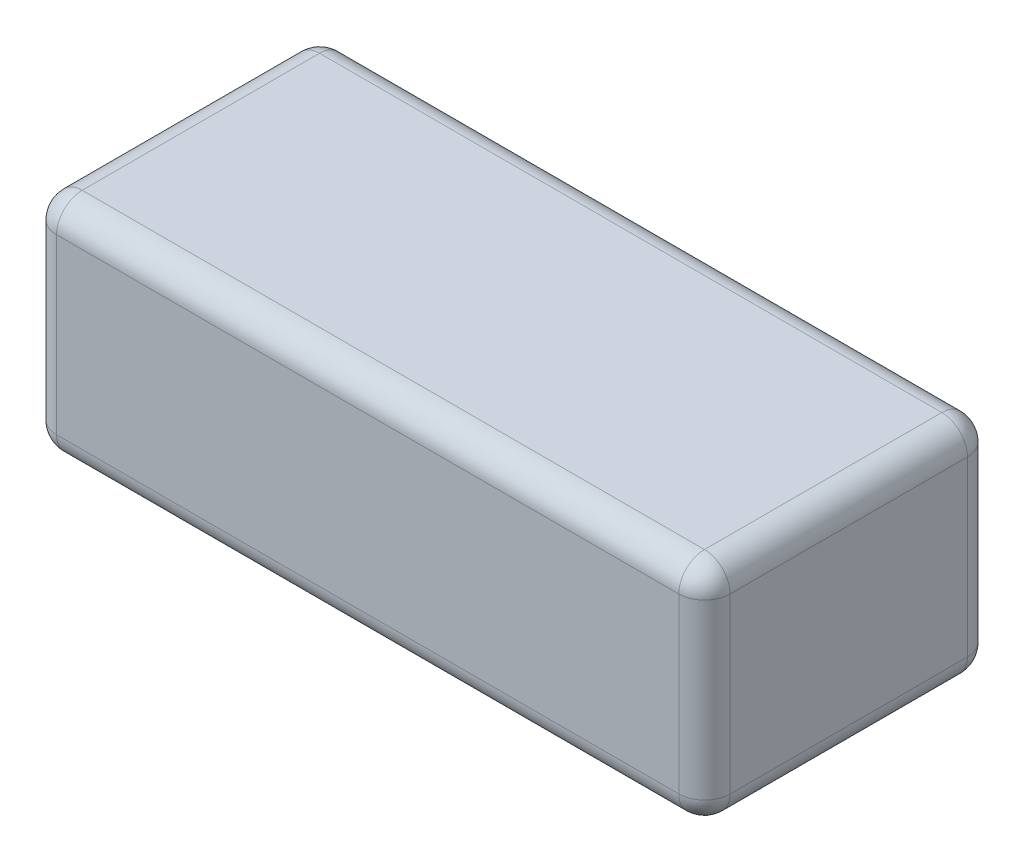
ISO-10303-21;
HEADER;
FILE_DESCRIPTION(('STEP AP214'),'2;1');
FILE_NAME('part.step','',(''),(''),'','','');
FILE_SCHEMA(('AUTOMOTIVE_DESIGN { 1 0 10303 214 1 1 1 1 }'));
ENDSEC;
DATA;
#1=APPLICATION_CONTEXT('core data for automotive mechanical design processes');
#2=APPLICATION_PROTOCOL_DEFINITION('international standard','automotive_design',2000,#1);
#3=PRODUCT_CONTEXT('',#1,'mechanical');
#4=PRODUCT('Part','Part','',(#3));
#5=PRODUCT_RELATED_PRODUCT_CATEGORY('part','',(#4));
#6=PRODUCT_DEFINITION_FORMATION('','',#4);
#7=PRODUCT_DEFINITION_CONTEXT('part definition',#1,'design');
#8=PRODUCT_DEFINITION('design','',#6,#7);
#9=PRODUCT_DEFINITION_SHAPE('','',#8);
#10=(LENGTH_UNIT() NAMED_UNIT(*) SI_UNIT(.MILLI.,.METRE.));
#11=(NAMED_UNIT(*) PLANE_ANGLE_UNIT() SI_UNIT($,.RADIAN.));
#12=(NAMED_UNIT(*) SI_UNIT($,.STERADIAN.) SOLID_ANGLE_UNIT());
#13=UNCERTAINTY_MEASURE_WITH_UNIT(LENGTH_MEASURE(1.E-05),#10,'distance_accuracy_value','');
#14=(GEOMETRIC_REPRESENTATION_CONTEXT(3) GLOBAL_UNCERTAINTY_ASSIGNED_CONTEXT((#13)) GLOBAL_UNIT_ASSIGNED_CONTEXT((#10,
#11,#12)) REPRESENTATION_CONTEXT('',''));
#15=CARTESIAN_POINT('',(0.,0.,0.));
#16=DIRECTION('',(0.,0.,1.));
#17=DIRECTION('',(1.,0.,0.));
#18=AXIS2_PLACEMENT_3D('',#15,#16,#17);
#19=CARTESIAN_POINT('',(52.5,35.,-22.5));
#20=DIRECTION('',(-1.,0.,0.));
#21=DIRECTION('',(0.,0.,1.));
#22=AXIS2_PLACEMENT_3D('',#19,#20,#21);
#23=PLANE('',#22);
#24=DIRECTION('',(0.,-1.,0.));
#25=VECTOR('',#24,1.);
#26=CARTESIAN_POINT('',(52.5,35.,18.5));
#27=LINE('',#26,#25);
#28=CARTESIAN_POINT('',(52.5,31.,18.5));
#29=VERTEX_POINT('',#28);
#30=CARTESIAN_POINT('',(52.5,4.,18.5));
#31=VERTEX_POINT('',#30);
#32=EDGE_CURVE('E132',#29,#31,#27,.T.);
#33=ORIENTED_EDGE('',*,*,#32,.T.);
#34=DIRECTION('',(0.,0.,-1.));
#35=VECTOR('',#34,1.);
#36=CARTESIAN_POINT('',(52.5,4.,-22.5));
#37=LINE('',#36,#35);
#38=CARTESIAN_POINT('',(52.5,4.,-18.5));
#39=VERTEX_POINT('',#38);
#40=EDGE_CURVE('E128',#31,#39,#37,.T.);
#41=ORIENTED_EDGE('',*,*,#40,.T.);
#42=DIRECTION('',(0.,-1.,0.));
#43=VECTOR('',#42,1.);
#44=CARTESIAN_POINT('',(52.5,35.,-18.5));
#45=LINE('',#44,#43);
#46=CARTESIAN_POINT('',(52.5,31.,-18.5));
#47=VERTEX_POINT('',#46);
#48=EDGE_CURVE('E121',#39,#47,#45,.F.);
#49=ORIENTED_EDGE('',*,*,#48,.T.);
#50=DIRECTION('',(0.,0.,-1.));
#51=VECTOR('',#50,1.);
#52=CARTESIAN_POINT('',(52.5,31.,22.5));
#53=LINE('',#52,#51);
#54=EDGE_CURVE('E125',#47,#29,#53,.F.);
#55=ORIENTED_EDGE('',*,*,#54,.T.);
#56=EDGE_LOOP('',(#33,#41,#49,#55));
#57=FACE_BOUND('',#56,.T.);
#58=ADVANCED_FACE('F33',(#57),#23,.F.);
#59=CARTESIAN_POINT('',(-52.5,35.,-22.5));
#60=DIRECTION('',(0.,0.,1.));
#61=DIRECTION('',(1.,0.,0.));
#62=AXIS2_PLACEMENT_3D('',#59,#60,#61);
#63=PLANE('',#62);
#64=DIRECTION('',(0.,-1.,0.));
#65=VECTOR('',#64,1.);
#66=CARTESIAN_POINT('',(48.5,35.,-22.5));
#67=LINE('',#66,#65);
#68=CARTESIAN_POINT('',(48.5,31.,-22.5));
#69=VERTEX_POINT('',#68);
#70=CARTESIAN_POINT('',(48.5,4.,-22.5));
#71=VERTEX_POINT('',#70);
#72=EDGE_CURVE('E140',#69,#71,#67,.T.);
#73=ORIENTED_EDGE('',*,*,#72,.T.);
#74=DIRECTION('',(-1.,0.,0.));
#75=VECTOR('',#74,1.);
#76=CARTESIAN_POINT('',(-52.5,4.,-22.5));
#77=LINE('',#76,#75);
#78=CARTESIAN_POINT('',(-48.5,4.,-22.5));
#79=VERTEX_POINT('',#78);
#80=EDGE_CURVE('E178',#71,#79,#77,.T.);
#81=ORIENTED_EDGE('',*,*,#80,.T.);
#82=DIRECTION('',(0.,-1.,0.));
#83=VECTOR('',#82,1.);
#84=CARTESIAN_POINT('',(-48.5,35.,-22.5));
#85=LINE('',#84,#83);
#86=CARTESIAN_POINT('',(-48.5,31.,-22.5));
#87=VERTEX_POINT('',#86);
#88=EDGE_CURVE('E175',#79,#87,#85,.F.);
#89=ORIENTED_EDGE('',*,*,#88,.T.);
#90=DIRECTION('',(-1.,0.,0.));
#91=VECTOR('',#90,1.);
#92=CARTESIAN_POINT('',(52.5,31.,-22.5));
#93=LINE('',#92,#91);
#94=EDGE_CURVE('E173',#87,#69,#93,.F.);
#95=ORIENTED_EDGE('',*,*,#94,.T.);
#96=EDGE_LOOP('',(#73,#81,#89,#95));
#97=FACE_BOUND('',#96,.T.);
#98=ADVANCED_FACE('F295',(#97),#63,.F.);
#99=CARTESIAN_POINT('',(-52.5,35.,-22.5));
#100=DIRECTION('',(1.,0.,0.));
#101=DIRECTION('',(0.,0.,-1.));
#102=AXIS2_PLACEMENT_3D('',#99,#100,#101);
#103=PLANE('',#102);
#104=DIRECTION('',(0.,-1.,0.));
#105=VECTOR('',#104,1.);
#106=CARTESIAN_POINT('',(-52.5,35.,-18.5));
#107=LINE('',#106,#105);
#108=CARTESIAN_POINT('',(-52.5,31.,-18.5));
#109=VERTEX_POINT('',#108);
#110=CARTESIAN_POINT('',(-52.5,4.,-18.5));
#111=VERTEX_POINT('',#110);
#112=EDGE_CURVE('E184',#109,#111,#107,.T.);
#113=ORIENTED_EDGE('',*,*,#112,.T.);
#114=DIRECTION('',(0.,0.,1.));
#115=VECTOR('',#114,1.);
#116=CARTESIAN_POINT('',(-52.5,4.,-22.5));
#117=LINE('',#116,#115);
#118=CARTESIAN_POINT('',(-52.5,4.,18.5));
#119=VERTEX_POINT('',#118);
#120=EDGE_CURVE('E187',#111,#119,#117,.T.);
#121=ORIENTED_EDGE('',*,*,#120,.T.);
#122=DIRECTION('',(0.,-1.,0.));
#123=VECTOR('',#122,1.);
#124=CARTESIAN_POINT('',(-52.5,35.,18.5));
#125=LINE('',#124,#123);
#126=CARTESIAN_POINT('',(-52.5,31.,18.5));
#127=VERTEX_POINT('',#126);
#128=EDGE_CURVE('E182',#119,#127,#125,.F.);
#129=ORIENTED_EDGE('',*,*,#128,.T.);
#130=DIRECTION('',(0.,0.,1.));
#131=VECTOR('',#130,1.);
#132=CARTESIAN_POINT('',(-52.5,31.,-22.5));
#133=LINE('',#132,#131);
#134=EDGE_CURVE('E180',#127,#109,#133,.F.);
#135=ORIENTED_EDGE('',*,*,#134,.T.);
#136=EDGE_LOOP('',(#113,#121,#129,#135));
#137=FACE_BOUND('',#136,.T.);
#138=ADVANCED_FACE('F272',(#137),#103,.F.);
#139=CARTESIAN_POINT('',(-52.5,35.,22.5));
#140=DIRECTION('',(0.,0.,-1.));
#141=DIRECTION('',(-1.,0.,0.));
#142=AXIS2_PLACEMENT_3D('',#139,#140,#141);
#143=PLANE('',#142);
#144=DIRECTION('',(0.,-1.,0.));
#145=VECTOR('',#144,1.);
#146=CARTESIAN_POINT('',(-48.5,35.,22.5));
#147=LINE('',#146,#145);
#148=CARTESIAN_POINT('',(-48.5,31.,22.5));
#149=VERTEX_POINT('',#148);
#150=CARTESIAN_POINT('',(-48.5,4.,22.5));
#151=VERTEX_POINT('',#150);
#152=EDGE_CURVE('E166',#149,#151,#147,.T.);
#153=ORIENTED_EDGE('',*,*,#152,.T.);
#154=DIRECTION('',(1.,0.,0.));
#155=VECTOR('',#154,1.);
#156=CARTESIAN_POINT('',(-52.5,4.,22.5));
#157=LINE('',#156,#155);
#158=CARTESIAN_POINT('',(48.5,4.,22.5));
#159=VERTEX_POINT('',#158);
#160=EDGE_CURVE('E171',#151,#159,#157,.T.);
#161=ORIENTED_EDGE('',*,*,#160,.T.);
#162=DIRECTION('',(0.,-1.,0.));
#163=VECTOR('',#162,1.);
#164=CARTESIAN_POINT('',(48.5,35.,22.5));
#165=LINE('',#164,#163);
#166=CARTESIAN_POINT('',(48.5,31.,22.5));
#167=VERTEX_POINT('',#166);
#168=EDGE_CURVE('E168',#159,#167,#165,.F.);
#169=ORIENTED_EDGE('',*,*,#168,.T.);
#170=DIRECTION('',(1.,0.,0.));
#171=VECTOR('',#170,1.);
#172=CARTESIAN_POINT('',(-52.5,31.,22.5));
#173=LINE('',#172,#171);
#174=EDGE_CURVE('E164',#167,#149,#173,.F.);
#175=ORIENTED_EDGE('',*,*,#174,.T.);
#176=EDGE_LOOP('',(#153,#161,#169,#175));
#177=FACE_BOUND('',#176,.T.);
#178=ADVANCED_FACE('F302',(#177),#143,.F.);
#179=CARTESIAN_POINT('',(0.,35.,0.));
#180=DIRECTION('',(0.,1.,0.));
#181=DIRECTION('',(0.,0.,1.));
#182=AXIS2_PLACEMENT_3D('',#179,#180,#181);
#183=PLANE('',#182);
#184=DIRECTION('',(0.,0.,1.));
#185=VECTOR('',#184,1.);
#186=CARTESIAN_POINT('',(-48.5,35.,22.5));
#187=LINE('',#186,#185);
#188=CARTESIAN_POINT('',(-48.5,35.,-18.5));
#189=VERTEX_POINT('',#188);
#190=CARTESIAN_POINT('',(-48.5,35.,18.5));
#191=VERTEX_POINT('',#190);
#192=EDGE_CURVE('E42',#189,#191,#187,.T.);
#193=ORIENTED_EDGE('',*,*,#192,.T.);
#194=DIRECTION('',(1.,0.,0.));
#195=VECTOR('',#194,1.);
#196=CARTESIAN_POINT('',(52.5,35.,18.5));
#197=LINE('',#196,#195);
#198=CARTESIAN_POINT('',(48.5,35.,18.5));
#199=VERTEX_POINT('',#198);
#200=EDGE_CURVE('E11',#191,#199,#197,.T.);
#201=ORIENTED_EDGE('',*,*,#200,.T.);
#202=DIRECTION('',(0.,0.,-1.));
#203=VECTOR('',#202,1.);
#204=CARTESIAN_POINT('',(48.5,35.,-22.5));
#205=LINE('',#204,#203);
#206=CARTESIAN_POINT('',(48.5,35.,-18.5));
#207=VERTEX_POINT('',#206);
#208=EDGE_CURVE('E198',#199,#207,#205,.T.);
#209=ORIENTED_EDGE('',*,*,#208,.T.);
#210=DIRECTION('',(-1.,0.,0.));
#211=VECTOR('',#210,1.);
#212=CARTESIAN_POINT('',(-52.5,35.,-18.5));
#213=LINE('',#212,#211);
#214=EDGE_CURVE('E53',#207,#189,#213,.T.);
#215=ORIENTED_EDGE('',*,*,#214,.T.);
#216=EDGE_LOOP('',(#193,#201,#209,#215));
#217=FACE_BOUND('',#216,.T.);
#218=ADVANCED_FACE('F365',(#217),#183,.T.);
#219=CARTESIAN_POINT('',(0.,0.,0.));
#220=DIRECTION('',(0.,1.,0.));
#221=DIRECTION('',(0.,0.,1.));
#222=AXIS2_PLACEMENT_3D('',#219,#220,#221);
#223=PLANE('',#222);
#224=DIRECTION('',(0.,0.,1.));
#225=VECTOR('',#224,1.);
#226=CARTESIAN_POINT('',(-48.5,0.,0.));
#227=LINE('',#226,#225);
#228=CARTESIAN_POINT('',(-48.5,0.,18.5));
#229=VERTEX_POINT('',#228);
#230=CARTESIAN_POINT('',(-48.5,0.,-18.5));
#231=VERTEX_POINT('',#230);
#232=EDGE_CURVE('E193',#229,#231,#227,.F.);
#233=ORIENTED_EDGE('',*,*,#232,.T.);
#234=DIRECTION('',(-1.,0.,0.));
#235=VECTOR('',#234,1.);
#236=CARTESIAN_POINT('',(0.,0.,-18.5));
#237=LINE('',#236,#235);
#238=CARTESIAN_POINT('',(48.5,0.,-18.5));
#239=VERTEX_POINT('',#238);
#240=EDGE_CURVE('E195',#231,#239,#237,.F.);
#241=ORIENTED_EDGE('',*,*,#240,.T.);
#242=DIRECTION('',(0.,0.,-1.));
#243=VECTOR('',#242,1.);
#244=CARTESIAN_POINT('',(48.5,0.,0.));
#245=LINE('',#244,#243);
#246=CARTESIAN_POINT('',(48.5,0.,18.5));
#247=VERTEX_POINT('',#246);
#248=EDGE_CURVE('E189',#239,#247,#245,.F.);
#249=ORIENTED_EDGE('',*,*,#248,.T.);
#250=DIRECTION('',(1.,0.,0.));
#251=VECTOR('',#250,1.);
#252=CARTESIAN_POINT('',(0.,0.,18.5));
#253=LINE('',#252,#251);
#254=EDGE_CURVE('E191',#247,#229,#253,.F.);
#255=ORIENTED_EDGE('',*,*,#254,.T.);
#256=EDGE_LOOP('',(#233,#241,#249,#255));
#257=FACE_BOUND('',#256,.T.);
#258=ADVANCED_FACE('F264',(#257),#223,.F.);
#259=CARTESIAN_POINT('',(-48.5,35.,-18.5));
#260=DIRECTION('',(0.,-1.,0.));
#261=DIRECTION('',(0.,0.,-1.));
#262=AXIS2_PLACEMENT_3D('',#259,#260,#261);
#263=CYLINDRICAL_SURFACE('',#262,4.);
#264=CARTESIAN_POINT('',(-48.5,31.,-18.5));
#265=DIRECTION('',(0.,1.,0.));
#266=DIRECTION('',(0.,0.,1.));
#267=AXIS2_PLACEMENT_3D('',#264,#265,#266);
#268=CIRCLE('',#267,4.);
#269=EDGE_CURVE('E37',#87,#109,#268,.T.);
#270=ORIENTED_EDGE('',*,*,#269,.F.);
#271=ORIENTED_EDGE('',*,*,#88,.F.);
#272=CARTESIAN_POINT('',(-48.5,4.,-18.5));
#273=DIRECTION('',(0.,-1.,0.));
#274=DIRECTION('',(0.,0.,-1.));
#275=AXIS2_PLACEMENT_3D('',#272,#273,#274);
#276=CIRCLE('',#275,4.);
#277=EDGE_CURVE('E160',#111,#79,#276,.T.);
#278=ORIENTED_EDGE('',*,*,#277,.F.);
#279=ORIENTED_EDGE('',*,*,#112,.F.);
#280=EDGE_LOOP('',(#270,#271,#278,#279));
#281=FACE_BOUND('',#280,.T.);
#282=ADVANCED_FACE('F35',(#281),#263,.T.);
#283=CARTESIAN_POINT('',(-48.5,31.,-18.5));
#284=DIRECTION('',(0.,0.,1.));
#285=DIRECTION('',(1.,0.,0.));
#286=AXIS2_PLACEMENT_3D('',#283,#284,#285);
#287=SPHERICAL_SURFACE('',#286,4.);
#288=CARTESIAN_POINT('',(-48.5,31.,-18.5));
#289=DIRECTION('',(-1.,0.,0.));
#290=DIRECTION('',(0.,0.,1.));
#291=AXIS2_PLACEMENT_3D('',#288,#289,#290);
#292=CIRCLE('',#291,4.);
#293=EDGE_CURVE('E245',#87,#189,#292,.F.);
#294=ORIENTED_EDGE('',*,*,#293,.F.);
#295=ORIENTED_EDGE('',*,*,#269,.T.);
#296=CARTESIAN_POINT('',(-48.5,31.,-18.5));
#297=DIRECTION('',(0.,0.,-1.));
#298=DIRECTION('',(-1.,0.,0.));
#299=AXIS2_PLACEMENT_3D('',#296,#297,#298);
#300=CIRCLE('',#299,4.);
#301=EDGE_CURVE('E247',#189,#109,#300,.F.);
#302=ORIENTED_EDGE('',*,*,#301,.F.);
#303=EDGE_LOOP('',(#294,#295,#302));
#304=FACE_BOUND('',#303,.T.);
#305=ADVANCED_FACE('F290',(#304),#287,.T.);
#306=CARTESIAN_POINT('',(-48.5,4.,-18.5));
#307=DIRECTION('',(0.,0.,1.));
#308=DIRECTION('',(1.,0.,0.));
#309=AXIS2_PLACEMENT_3D('',#306,#307,#308);
#310=SPHERICAL_SURFACE('',#309,4.);
#311=CARTESIAN_POINT('',(-48.5,4.,-18.5));
#312=DIRECTION('',(0.,0.,-1.));
#313=DIRECTION('',(-1.,0.,0.));
#314=AXIS2_PLACEMENT_3D('',#311,#312,#313);
#315=CIRCLE('',#314,4.);
#316=EDGE_CURVE('E239',#111,#231,#315,.F.);
#317=ORIENTED_EDGE('',*,*,#316,.F.);
#318=ORIENTED_EDGE('',*,*,#277,.T.);
#319=CARTESIAN_POINT('',(-48.5,4.,-18.5));
#320=DIRECTION('',(-1.,0.,0.));
#321=DIRECTION('',(0.,0.,1.));
#322=AXIS2_PLACEMENT_3D('',#319,#320,#321);
#323=CIRCLE('',#322,4.);
#324=EDGE_CURVE('E242',#231,#79,#323,.F.);
#325=ORIENTED_EDGE('',*,*,#324,.F.);
#326=EDGE_LOOP('',(#317,#318,#325));
#327=FACE_BOUND('',#326,.T.);
#328=ADVANCED_FACE('F254',(#327),#310,.T.);
#329=CARTESIAN_POINT('',(-48.5,31.,0.));
#330=DIRECTION('',(0.,0.,-1.));
#331=DIRECTION('',(-1.,0.,0.));
#332=AXIS2_PLACEMENT_3D('',#329,#330,#331);
#333=CYLINDRICAL_SURFACE('',#332,4.);
#334=ORIENTED_EDGE('',*,*,#301,.T.);
#335=ORIENTED_EDGE('',*,*,#134,.F.);
#336=CARTESIAN_POINT('',(-48.5,31.,18.5));
#337=DIRECTION('',(0.,0.,1.));
#338=DIRECTION('',(1.,0.,0.));
#339=AXIS2_PLACEMENT_3D('',#336,#337,#338);
#340=CIRCLE('',#339,4.);
#341=EDGE_CURVE('E233',#191,#127,#340,.T.);
#342=ORIENTED_EDGE('',*,*,#341,.F.);
#343=ORIENTED_EDGE('',*,*,#192,.F.);
#344=EDGE_LOOP('',(#334,#335,#342,#343));
#345=FACE_BOUND('',#344,.T.);
#346=ADVANCED_FACE('F285',(#345),#333,.T.);
#347=CARTESIAN_POINT('',(0.,31.,-18.5));
#348=DIRECTION('',(1.,0.,0.));
#349=DIRECTION('',(0.,0.,-1.));
#350=AXIS2_PLACEMENT_3D('',#347,#348,#349);
#351=CYLINDRICAL_SURFACE('',#350,4.);
#352=ORIENTED_EDGE('',*,*,#293,.T.);
#353=ORIENTED_EDGE('',*,*,#214,.F.);
#354=CARTESIAN_POINT('',(48.5,31.,-18.5));
#355=DIRECTION('',(1.,0.,0.));
#356=DIRECTION('',(0.,1.,0.));
#357=AXIS2_PLACEMENT_3D('',#354,#355,#356);
#358=CIRCLE('',#357,4.);
#359=EDGE_CURVE('E144',#69,#207,#358,.T.);
#360=ORIENTED_EDGE('',*,*,#359,.F.);
#361=ORIENTED_EDGE('',*,*,#94,.F.);
#362=EDGE_LOOP('',(#352,#353,#360,#361));
#363=FACE_BOUND('',#362,.T.);
#364=ADVANCED_FACE('F293',(#363),#351,.T.);
#365=CARTESIAN_POINT('',(48.5,35.,-18.5));
#366=DIRECTION('',(0.,-1.,0.));
#367=DIRECTION('',(0.,0.,-1.));
#368=AXIS2_PLACEMENT_3D('',#365,#366,#367);
#369=CYLINDRICAL_SURFACE('',#368,4.);
#370=CARTESIAN_POINT('',(48.5,4.,-18.5));
#371=DIRECTION('',(0.,-1.,0.));
#372=DIRECTION('',(0.,0.,-1.));
#373=AXIS2_PLACEMENT_3D('',#370,#371,#372);
#374=CIRCLE('',#373,4.);
#375=EDGE_CURVE('E145',#71,#39,#374,.T.);
#376=ORIENTED_EDGE('',*,*,#375,.F.);
#377=ORIENTED_EDGE('',*,*,#72,.F.);
#378=CARTESIAN_POINT('',(48.5,31.,-18.5));
#379=DIRECTION('',(0.,1.,0.));
#380=DIRECTION('',(0.,0.,1.));
#381=AXIS2_PLACEMENT_3D('',#378,#379,#380);
#382=CIRCLE('',#381,4.);
#383=EDGE_CURVE('E136',#47,#69,#382,.T.);
#384=ORIENTED_EDGE('',*,*,#383,.F.);
#385=ORIENTED_EDGE('',*,*,#48,.F.);
#386=EDGE_LOOP('',(#376,#377,#384,#385));
#387=FACE_BOUND('',#386,.T.);
#388=ADVANCED_FACE('F138',(#387),#369,.T.);
#389=CARTESIAN_POINT('',(-52.5,4.,-18.5));
#390=DIRECTION('',(-1.,0.,0.));
#391=DIRECTION('',(0.,0.,1.));
#392=AXIS2_PLACEMENT_3D('',#389,#390,#391);
#393=CYLINDRICAL_SURFACE('',#392,4.);
#394=ORIENTED_EDGE('',*,*,#324,.T.);
#395=ORIENTED_EDGE('',*,*,#80,.F.);
#396=CARTESIAN_POINT('',(48.5,4.,-18.5));
#397=DIRECTION('',(1.,0.,0.));
#398=DIRECTION('',(0.,0.,-1.));
#399=AXIS2_PLACEMENT_3D('',#396,#397,#398);
#400=CIRCLE('',#399,4.);
#401=EDGE_CURVE('E229',#239,#71,#400,.T.);
#402=ORIENTED_EDGE('',*,*,#401,.F.);
#403=ORIENTED_EDGE('',*,*,#240,.F.);
#404=EDGE_LOOP('',(#394,#395,#402,#403));
#405=FACE_BOUND('',#404,.T.);
#406=ADVANCED_FACE('F261',(#405),#393,.T.);
#407=CARTESIAN_POINT('',(-48.5,4.,-22.5));
#408=DIRECTION('',(0.,0.,1.));
#409=DIRECTION('',(1.,0.,0.));
#410=AXIS2_PLACEMENT_3D('',#407,#408,#409);
#411=CYLINDRICAL_SURFACE('',#410,4.);
#412=ORIENTED_EDGE('',*,*,#316,.T.);
#413=ORIENTED_EDGE('',*,*,#232,.F.);
#414=CARTESIAN_POINT('',(-48.5,4.,18.5));
#415=DIRECTION('',(0.,0.,1.));
#416=DIRECTION('',(1.,0.,0.));
#417=AXIS2_PLACEMENT_3D('',#414,#415,#416);
#418=CIRCLE('',#417,4.);
#419=EDGE_CURVE('E226',#119,#229,#418,.T.);
#420=ORIENTED_EDGE('',*,*,#419,.F.);
#421=ORIENTED_EDGE('',*,*,#120,.F.);
#422=EDGE_LOOP('',(#412,#413,#420,#421));
#423=FACE_BOUND('',#422,.T.);
#424=ADVANCED_FACE('F269',(#423),#411,.T.);
#425=CARTESIAN_POINT('',(-48.5,35.,18.5));
#426=DIRECTION('',(0.,-1.,0.));
#427=DIRECTION('',(0.,0.,-1.));
#428=AXIS2_PLACEMENT_3D('',#425,#426,#427);
#429=CYLINDRICAL_SURFACE('',#428,4.);
#430=CARTESIAN_POINT('',(-48.5,31.,18.5));
#431=DIRECTION('',(0.,1.,0.));
#432=DIRECTION('',(0.,0.,1.));
#433=AXIS2_PLACEMENT_3D('',#430,#431,#432);
#434=CIRCLE('',#433,4.);
#435=EDGE_CURVE('E236',#127,#149,#434,.T.);
#436=ORIENTED_EDGE('',*,*,#435,.F.);
#437=ORIENTED_EDGE('',*,*,#128,.F.);
#438=CARTESIAN_POINT('',(-48.5,4.,18.5));
#439=DIRECTION('',(0.,-1.,0.));
#440=DIRECTION('',(0.,0.,-1.));
#441=AXIS2_PLACEMENT_3D('',#438,#439,#440);
#442=CIRCLE('',#441,4.);
#443=EDGE_CURVE('E223',#151,#119,#442,.T.);
#444=ORIENTED_EDGE('',*,*,#443,.F.);
#445=ORIENTED_EDGE('',*,*,#152,.F.);
#446=EDGE_LOOP('',(#436,#437,#444,#445));
#447=FACE_BOUND('',#446,.T.);
#448=ADVANCED_FACE('F277',(#447),#429,.T.);
#449=CARTESIAN_POINT('',(-48.5,31.,18.5));
#450=DIRECTION('',(0.,0.,1.));
#451=DIRECTION('',(1.,0.,0.));
#452=AXIS2_PLACEMENT_3D('',#449,#450,#451);
#453=SPHERICAL_SURFACE('',#452,4.);
#454=ORIENTED_EDGE('',*,*,#341,.T.);
#455=ORIENTED_EDGE('',*,*,#435,.T.);
#456=CARTESIAN_POINT('',(-48.5,31.,18.5));
#457=DIRECTION('',(-1.,0.,0.));
#458=DIRECTION('',(0.,-1.,0.));
#459=AXIS2_PLACEMENT_3D('',#456,#457,#458);
#460=CIRCLE('',#459,4.);
#461=EDGE_CURVE('E152',#191,#149,#460,.F.);
#462=ORIENTED_EDGE('',*,*,#461,.F.);
#463=EDGE_LOOP('',(#454,#455,#462));
#464=FACE_BOUND('',#463,.T.);
#465=ADVANCED_FACE('F282',(#464),#453,.T.);
#466=CARTESIAN_POINT('',(48.5,31.,-18.5));
#467=DIRECTION('',(0.,0.,1.));
#468=DIRECTION('',(1.,0.,0.));
#469=AXIS2_PLACEMENT_3D('',#466,#467,#468);
#470=SPHERICAL_SURFACE('',#469,4.);
#471=ORIENTED_EDGE('',*,*,#383,.T.);
#472=ORIENTED_EDGE('',*,*,#359,.T.);
#473=CARTESIAN_POINT('',(48.5,31.,-18.5));
#474=DIRECTION('',(0.,0.,-1.));
#475=DIRECTION('',(-1.,0.,0.));
#476=AXIS2_PLACEMENT_3D('',#473,#474,#475);
#477=CIRCLE('',#476,4.);
#478=EDGE_CURVE('E148',#47,#207,#477,.F.);
#479=ORIENTED_EDGE('',*,*,#478,.F.);
#480=EDGE_LOOP('',(#471,#472,#479));
#481=FACE_BOUND('',#480,.T.);
#482=ADVANCED_FACE('F149',(#481),#470,.T.);
#483=CARTESIAN_POINT('',(48.5,4.,-18.5));
#484=DIRECTION('',(0.,0.,1.));
#485=DIRECTION('',(1.,0.,0.));
#486=AXIS2_PLACEMENT_3D('',#483,#484,#485);
#487=SPHERICAL_SURFACE('',#486,4.);
#488=ORIENTED_EDGE('',*,*,#401,.T.);
#489=ORIENTED_EDGE('',*,*,#375,.T.);
#490=CARTESIAN_POINT('',(48.5,4.,-18.5));
#491=DIRECTION('',(0.,0.,-1.));
#492=DIRECTION('',(-1.,0.,0.));
#493=AXIS2_PLACEMENT_3D('',#490,#491,#492);
#494=CIRCLE('',#493,4.);
#495=EDGE_CURVE('E153',#239,#39,#494,.F.);
#496=ORIENTED_EDGE('',*,*,#495,.F.);
#497=EDGE_LOOP('',(#488,#489,#496));
#498=FACE_BOUND('',#497,.T.);
#499=ADVANCED_FACE('F336',(#498),#487,.T.);
#500=CARTESIAN_POINT('',(-48.5,4.,18.5));
#501=DIRECTION('',(0.,0.,1.));
#502=DIRECTION('',(1.,0.,0.));
#503=AXIS2_PLACEMENT_3D('',#500,#501,#502);
#504=SPHERICAL_SURFACE('',#503,4.);
#505=ORIENTED_EDGE('',*,*,#443,.T.);
#506=ORIENTED_EDGE('',*,*,#419,.T.);
#507=CARTESIAN_POINT('',(-48.5,4.,18.5));
#508=DIRECTION('',(-1.,0.,0.));
#509=DIRECTION('',(0.,0.,1.));
#510=AXIS2_PLACEMENT_3D('',#507,#508,#509);
#511=CIRCLE('',#510,4.);
#512=EDGE_CURVE('E216',#151,#229,#511,.F.);
#513=ORIENTED_EDGE('',*,*,#512,.F.);
#514=EDGE_LOOP('',(#505,#506,#513));
#515=FACE_BOUND('',#514,.T.);
#516=ADVANCED_FACE('F332',(#515),#504,.T.);
#517=CARTESIAN_POINT('',(0.,31.,18.5));
#518=DIRECTION('',(-1.,0.,0.));
#519=DIRECTION('',(0.,0.,1.));
#520=AXIS2_PLACEMENT_3D('',#517,#518,#519);
#521=CYLINDRICAL_SURFACE('',#520,4.);
#522=ORIENTED_EDGE('',*,*,#461,.T.);
#523=ORIENTED_EDGE('',*,*,#174,.F.);
#524=CARTESIAN_POINT('',(48.5,31.,18.5));
#525=DIRECTION('',(1.,0.,0.));
#526=DIRECTION('',(0.,0.,-1.));
#527=AXIS2_PLACEMENT_3D('',#524,#525,#526);
#528=CIRCLE('',#527,4.);
#529=EDGE_CURVE('E213',#199,#167,#528,.T.);
#530=ORIENTED_EDGE('',*,*,#529,.F.);
#531=ORIENTED_EDGE('',*,*,#200,.F.);
#532=EDGE_LOOP('',(#522,#523,#530,#531));
#533=FACE_BOUND('',#532,.T.);
#534=ADVANCED_FACE('F329',(#533),#521,.T.);
#535=CARTESIAN_POINT('',(48.5,31.,0.));
#536=DIRECTION('',(0.,0.,1.));
#537=DIRECTION('',(1.,0.,0.));
#538=AXIS2_PLACEMENT_3D('',#535,#536,#537);
#539=CYLINDRICAL_SURFACE('',#538,4.);
#540=ORIENTED_EDGE('',*,*,#478,.T.);
#541=ORIENTED_EDGE('',*,*,#208,.F.);
#542=CARTESIAN_POINT('',(48.5,31.,18.5));
#543=DIRECTION('',(0.,0.,1.));
#544=DIRECTION('',(0.,-1.,0.));
#545=AXIS2_PLACEMENT_3D('',#542,#543,#544);
#546=CIRCLE('',#545,4.);
#547=EDGE_CURVE('E156',#29,#199,#546,.T.);
#548=ORIENTED_EDGE('',*,*,#547,.F.);
#549=ORIENTED_EDGE('',*,*,#54,.F.);
#550=EDGE_LOOP('',(#540,#541,#548,#549));
#551=FACE_BOUND('',#550,.T.);
#552=ADVANCED_FACE('F155',(#551),#539,.T.);
#553=CARTESIAN_POINT('',(48.5,4.,-22.5));
#554=DIRECTION('',(0.,0.,-1.));
#555=DIRECTION('',(-1.,0.,0.));
#556=AXIS2_PLACEMENT_3D('',#553,#554,#555);
#557=CYLINDRICAL_SURFACE('',#556,4.);
#558=ORIENTED_EDGE('',*,*,#495,.T.);
#559=ORIENTED_EDGE('',*,*,#40,.F.);
#560=CARTESIAN_POINT('',(48.5,4.,18.5));
#561=DIRECTION('',(0.,0.,1.));
#562=DIRECTION('',(1.,0.,0.));
#563=AXIS2_PLACEMENT_3D('',#560,#561,#562);
#564=CIRCLE('',#563,4.);
#565=EDGE_CURVE('E209',#247,#31,#564,.T.);
#566=ORIENTED_EDGE('',*,*,#565,.F.);
#567=ORIENTED_EDGE('',*,*,#248,.F.);
#568=EDGE_LOOP('',(#558,#559,#566,#567));
#569=FACE_BOUND('',#568,.T.);
#570=ADVANCED_FACE('F322',(#569),#557,.T.);
#571=CARTESIAN_POINT('',(-52.5,4.,18.5));
#572=DIRECTION('',(1.,0.,0.));
#573=DIRECTION('',(0.,0.,-1.));
#574=AXIS2_PLACEMENT_3D('',#571,#572,#573);
#575=CYLINDRICAL_SURFACE('',#574,4.);
#576=ORIENTED_EDGE('',*,*,#512,.T.);
#577=ORIENTED_EDGE('',*,*,#254,.F.);
#578=CARTESIAN_POINT('',(48.5,4.,18.5));
#579=DIRECTION('',(1.,0.,0.));
#580=DIRECTION('',(0.,0.,-1.));
#581=AXIS2_PLACEMENT_3D('',#578,#579,#580);
#582=CIRCLE('',#581,4.);
#583=EDGE_CURVE('E206',#159,#247,#582,.T.);
#584=ORIENTED_EDGE('',*,*,#583,.F.);
#585=ORIENTED_EDGE('',*,*,#160,.F.);
#586=EDGE_LOOP('',(#576,#577,#584,#585));
#587=FACE_BOUND('',#586,.T.);
#588=ADVANCED_FACE('F318',(#587),#575,.T.);
#589=CARTESIAN_POINT('',(48.5,31.,18.5));
#590=DIRECTION('',(0.,0.,1.));
#591=DIRECTION('',(1.,0.,0.));
#592=AXIS2_PLACEMENT_3D('',#589,#590,#591);
#593=SPHERICAL_SURFACE('',#592,4.);
#594=ORIENTED_EDGE('',*,*,#547,.T.);
#595=ORIENTED_EDGE('',*,*,#529,.T.);
#596=CARTESIAN_POINT('',(48.5,31.,18.5));
#597=DIRECTION('',(0.,1.,0.));
#598=DIRECTION('',(0.,0.,1.));
#599=AXIS2_PLACEMENT_3D('',#596,#597,#598);
#600=CIRCLE('',#599,4.);
#601=EDGE_CURVE('E204',#29,#167,#600,.F.);
#602=ORIENTED_EDGE('',*,*,#601,.F.);
#603=EDGE_LOOP('',(#594,#595,#602));
#604=FACE_BOUND('',#603,.T.);
#605=ADVANCED_FACE('F314',(#604),#593,.T.);
#606=CARTESIAN_POINT('',(48.5,4.,18.5));
#607=DIRECTION('',(0.,0.,1.));
#608=DIRECTION('',(1.,0.,0.));
#609=AXIS2_PLACEMENT_3D('',#606,#607,#608);
#610=SPHERICAL_SURFACE('',#609,4.);
#611=ORIENTED_EDGE('',*,*,#583,.T.);
#612=ORIENTED_EDGE('',*,*,#565,.T.);
#613=CARTESIAN_POINT('',(48.5,4.,18.5));
#614=DIRECTION('',(0.,-1.,0.));
#615=DIRECTION('',(0.,0.,-1.));
#616=AXIS2_PLACEMENT_3D('',#613,#614,#615);
#617=CIRCLE('',#616,4.);
#618=EDGE_CURVE('E202',#159,#31,#617,.F.);
#619=ORIENTED_EDGE('',*,*,#618,.F.);
#620=EDGE_LOOP('',(#611,#612,#619));
#621=FACE_BOUND('',#620,.T.);
#622=ADVANCED_FACE('F310',(#621),#610,.T.);
#623=CARTESIAN_POINT('',(48.5,35.,18.5));
#624=DIRECTION('',(0.,-1.,0.));
#625=DIRECTION('',(0.,0.,-1.));
#626=AXIS2_PLACEMENT_3D('',#623,#624,#625);
#627=CYLINDRICAL_SURFACE('',#626,4.);
#628=ORIENTED_EDGE('',*,*,#601,.T.);
#629=ORIENTED_EDGE('',*,*,#168,.F.);
#630=ORIENTED_EDGE('',*,*,#618,.T.);
#631=ORIENTED_EDGE('',*,*,#32,.F.);
#632=EDGE_LOOP('',(#628,#629,#630,#631));
#633=FACE_BOUND('',#632,.T.);
#634=ADVANCED_FACE('F307',(#633),#627,.T.);
#635=CLOSED_SHELL('',(#58,#98,#138,#178,#218,#258,#282,#305,#328,#346,#364,#388,#406,#424,#448,
#465,#482,#499,#516,#534,#552,#570,#588,#605,#622,#634));
#636=MANIFOLD_SOLID_BREP('B2',#635);
#637=ADVANCED_BREP_SHAPE_REPRESENTATION('',(#18,#636),#14);
#638=SHAPE_DEFINITION_REPRESENTATION(#9,#637);
ENDSEC;
END-ISO-10303-21;
